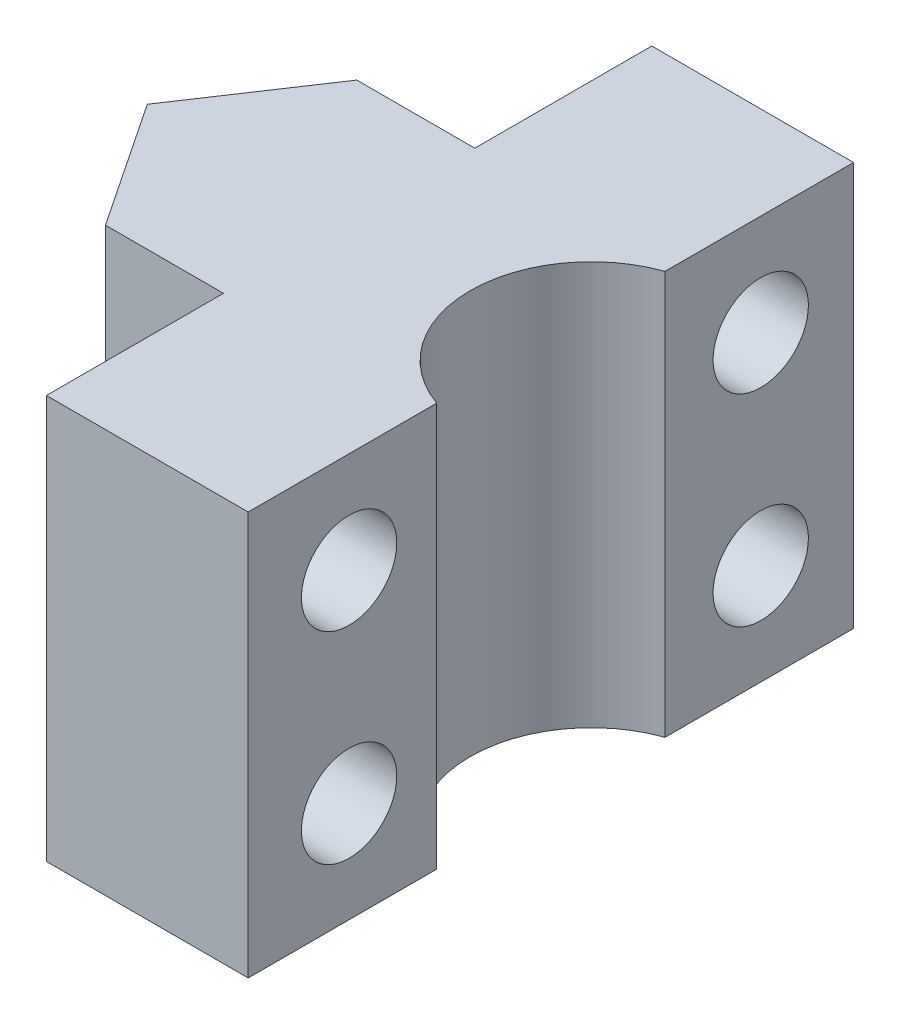
ISO-10303-21;
HEADER;
FILE_DESCRIPTION(('STEP AP214'),'2;1');
FILE_NAME('part.step','',(''),(''),'','','');
FILE_SCHEMA(('AUTOMOTIVE_DESIGN { 1 0 10303 214 1 1 1 1 }'));
ENDSEC;
DATA;
#1=APPLICATION_CONTEXT('core data for automotive mechanical design processes');
#2=APPLICATION_PROTOCOL_DEFINITION('international standard','automotive_design',2000,#1);
#3=PRODUCT_CONTEXT('',#1,'mechanical');
#4=PRODUCT('Part','Part','',(#3));
#5=PRODUCT_RELATED_PRODUCT_CATEGORY('part','',(#4));
#6=PRODUCT_DEFINITION_FORMATION('','',#4);
#7=PRODUCT_DEFINITION_CONTEXT('part definition',#1,'design');
#8=PRODUCT_DEFINITION('design','',#6,#7);
#9=PRODUCT_DEFINITION_SHAPE('','',#8);
#10=(LENGTH_UNIT() NAMED_UNIT(*) SI_UNIT(.MILLI.,.METRE.));
#11=(NAMED_UNIT(*) PLANE_ANGLE_UNIT() SI_UNIT($,.RADIAN.));
#12=(NAMED_UNIT(*) SI_UNIT($,.STERADIAN.) SOLID_ANGLE_UNIT());
#13=UNCERTAINTY_MEASURE_WITH_UNIT(LENGTH_MEASURE(1.E-05),#10,'distance_accuracy_value','');
#14=(GEOMETRIC_REPRESENTATION_CONTEXT(3) GLOBAL_UNCERTAINTY_ASSIGNED_CONTEXT((#13)) GLOBAL_UNIT_ASSIGNED_CONTEXT((#10,
#11,#12)) REPRESENTATION_CONTEXT('',''));
#15=CARTESIAN_POINT('',(0.,0.,0.));
#16=DIRECTION('',(0.,0.,1.));
#17=DIRECTION('',(1.,0.,0.));
#18=AXIS2_PLACEMENT_3D('',#15,#16,#17);
#19=CARTESIAN_POINT('',(0.,12.7,0.));
#20=DIRECTION('',(0.,-1.,0.));
#21=DIRECTION('',(0.,0.,-1.));
#22=AXIS2_PLACEMENT_3D('',#19,#20,#21);
#23=PLANE('',#22);
#24=DIRECTION('',(1.,0.,0.));
#25=VECTOR('',#24,1.);
#26=CARTESIAN_POINT('',(2.63646631403894,12.7,-13.4796994710584));
#27=LINE('',#26,#25);
#28=CARTESIAN_POINT('',(2.63646631403894,12.7,-13.4796994710584));
#29=VERTEX_POINT('',#28);
#30=CARTESIAN_POINT('',(6.35,12.7,-13.4796994710584));
#31=VERTEX_POINT('',#30);
#32=EDGE_CURVE('E121',#29,#31,#27,.T.);
#33=ORIENTED_EDGE('',*,*,#32,.F.);
#34=DIRECTION('',(0.554700196225229,0.,-0.832050294337844));
#35=VECTOR('',#34,1.);
#36=CARTESIAN_POINT('',(-4.39615384615385,12.7,-2.93076923076923));
#37=LINE('',#36,#35);
#38=CARTESIAN_POINT('',(0.,12.7,-9.52500000000001));
#39=VERTEX_POINT('',#38);
#40=EDGE_CURVE('E190',#39,#29,#37,.T.);
#41=ORIENTED_EDGE('',*,*,#40,.F.);
#42=DIRECTION('',(-0.554700196225229,0.,-0.832050294337844));
#43=VECTOR('',#42,1.);
#44=CARTESIAN_POINT('',(4.39615384615385,12.7,-2.93076923076923));
#45=LINE('',#44,#43);
#46=CARTESIAN_POINT('',(2.63646631403894,12.7,-5.5703005289416));
#47=VERTEX_POINT('',#46);
#48=EDGE_CURVE('E187',#47,#39,#45,.T.);
#49=ORIENTED_EDGE('',*,*,#48,.F.);
#50=DIRECTION('',(1.,0.,0.));
#51=VECTOR('',#50,1.);
#52=CARTESIAN_POINT('',(2.63646631403894,12.7,-5.5703005289416));
#53=LINE('',#52,#51);
#54=CARTESIAN_POINT('',(6.35,12.7,-5.5703005289416));
#55=VERTEX_POINT('',#54);
#56=EDGE_CURVE('E54',#47,#55,#53,.T.);
#57=ORIENTED_EDGE('',*,*,#56,.T.);
#58=DIRECTION('',(0.,0.,1.));
#59=VECTOR('',#58,1.);
#60=CARTESIAN_POINT('',(6.35,12.7,0.));
#61=LINE('',#60,#59);
#62=CARTESIAN_POINT('',(6.35,12.7,0.));
#63=VERTEX_POINT('',#62);
#64=EDGE_CURVE('E156',#55,#63,#61,.T.);
#65=ORIENTED_EDGE('',*,*,#64,.T.);
#66=DIRECTION('',(1.,0.,0.));
#67=VECTOR('',#66,1.);
#68=CARTESIAN_POINT('',(0.,12.7,0.));
#69=LINE('',#68,#67);
#70=CARTESIAN_POINT('',(12.7,12.7,0.));
#71=VERTEX_POINT('',#70);
#72=EDGE_CURVE('E207',#63,#71,#69,.T.);
#73=ORIENTED_EDGE('',*,*,#72,.T.);
#74=DIRECTION('',(0.,0.,-1.));
#75=VECTOR('',#74,1.);
#76=CARTESIAN_POINT('',(12.7,12.7,0.));
#77=LINE('',#76,#75);
#78=CARTESIAN_POINT('',(12.7,12.7,-5.93289755157234));
#79=VERTEX_POINT('',#78);
#80=EDGE_CURVE('E211',#71,#79,#77,.T.);
#81=ORIENTED_EDGE('',*,*,#80,.T.);
#82=CARTESIAN_POINT('',(13.97,12.7,-9.525));
#83=DIRECTION('',(0.,1.,0.));
#84=DIRECTION('',(0.,0.,1.));
#85=AXIS2_PLACEMENT_3D('',#82,#83,#84);
#86=CIRCLE('',#85,3.81);
#87=CARTESIAN_POINT('',(12.7,12.7,-13.1171024484277));
#88=VERTEX_POINT('',#87);
#89=EDGE_CURVE('E183',#88,#79,#86,.T.);
#90=ORIENTED_EDGE('',*,*,#89,.F.);
#91=CARTESIAN_POINT('',(12.7,12.7,-19.05));
#92=VERTEX_POINT('',#91);
#93=EDGE_CURVE('E209',#88,#92,#77,.T.);
#94=ORIENTED_EDGE('',*,*,#93,.T.);
#95=DIRECTION('',(-1.,0.,0.));
#96=VECTOR('',#95,1.);
#97=CARTESIAN_POINT('',(0.,12.7,-19.05));
#98=LINE('',#97,#96);
#99=CARTESIAN_POINT('',(6.35,12.7,-19.05));
#100=VERTEX_POINT('',#99);
#101=EDGE_CURVE('E144',#92,#100,#98,.T.);
#102=ORIENTED_EDGE('',*,*,#101,.T.);
#103=DIRECTION('',(0.,0.,-1.));
#104=VECTOR('',#103,1.);
#105=CARTESIAN_POINT('',(6.35,12.7,-19.05));
#106=LINE('',#105,#104);
#107=EDGE_CURVE('E132',#31,#100,#106,.T.);
#108=ORIENTED_EDGE('',*,*,#107,.F.);
#109=EDGE_LOOP('',(#33,#41,#49,#57,#65,#73,#81,#90,#94,#102,#108));
#110=FACE_BOUND('',#109,.T.);
#111=ADVANCED_FACE('F37',(#110),#23,.F.);
#112=CARTESIAN_POINT('',(0.,0.,0.));
#113=DIRECTION('',(0.,-1.,0.));
#114=DIRECTION('',(0.,0.,-1.));
#115=AXIS2_PLACEMENT_3D('',#112,#113,#114);
#116=PLANE('',#115);
#117=DIRECTION('',(0.554700196225229,0.,-0.832050294337844));
#118=VECTOR('',#117,1.);
#119=CARTESIAN_POINT('',(-4.39615384615385,0.,-2.93076923076923));
#120=LINE('',#119,#118);
#121=CARTESIAN_POINT('',(0.,0.,-9.52500000000001));
#122=VERTEX_POINT('',#121);
#123=CARTESIAN_POINT('',(2.63646631403894,0.,-13.4796994710584));
#124=VERTEX_POINT('',#123);
#125=EDGE_CURVE('E197',#122,#124,#120,.T.);
#126=ORIENTED_EDGE('',*,*,#125,.T.);
#127=DIRECTION('',(1.,0.,0.));
#128=VECTOR('',#127,1.);
#129=CARTESIAN_POINT('',(2.63646631403894,0.,-13.4796994710584));
#130=LINE('',#129,#128);
#131=CARTESIAN_POINT('',(6.35,0.,-13.4796994710584));
#132=VERTEX_POINT('',#131);
#133=EDGE_CURVE('E145',#124,#132,#130,.T.);
#134=ORIENTED_EDGE('',*,*,#133,.T.);
#135=DIRECTION('',(0.,0.,-1.));
#136=VECTOR('',#135,1.);
#137=CARTESIAN_POINT('',(6.35,0.,-19.05));
#138=LINE('',#137,#136);
#139=CARTESIAN_POINT('',(6.35,0.,-19.05));
#140=VERTEX_POINT('',#139);
#141=EDGE_CURVE('E139',#132,#140,#138,.T.);
#142=ORIENTED_EDGE('',*,*,#141,.T.);
#143=DIRECTION('',(-1.,0.,0.));
#144=VECTOR('',#143,1.);
#145=CARTESIAN_POINT('',(0.,0.,-19.05));
#146=LINE('',#145,#144);
#147=CARTESIAN_POINT('',(12.7,0.,-19.05));
#148=VERTEX_POINT('',#147);
#149=EDGE_CURVE('E210',#148,#140,#146,.T.);
#150=ORIENTED_EDGE('',*,*,#149,.F.);
#151=DIRECTION('',(0.,0.,-1.));
#152=VECTOR('',#151,1.);
#153=CARTESIAN_POINT('',(12.7,0.,0.));
#154=LINE('',#153,#152);
#155=CARTESIAN_POINT('',(12.7,0.,-13.1171024484277));
#156=VERTEX_POINT('',#155);
#157=EDGE_CURVE('E216',#156,#148,#154,.T.);
#158=ORIENTED_EDGE('',*,*,#157,.F.);
#159=CARTESIAN_POINT('',(13.97,0.,-9.525));
#160=DIRECTION('',(0.,1.,0.));
#161=DIRECTION('',(0.,0.,1.));
#162=AXIS2_PLACEMENT_3D('',#159,#160,#161);
#163=CIRCLE('',#162,3.81);
#164=CARTESIAN_POINT('',(12.7,0.,-5.93289755157234));
#165=VERTEX_POINT('',#164);
#166=EDGE_CURVE('E191',#156,#165,#163,.T.);
#167=ORIENTED_EDGE('',*,*,#166,.T.);
#168=CARTESIAN_POINT('',(12.7,0.,0.));
#169=VERTEX_POINT('',#168);
#170=EDGE_CURVE('E217',#169,#165,#154,.T.);
#171=ORIENTED_EDGE('',*,*,#170,.F.);
#172=DIRECTION('',(1.,0.,0.));
#173=VECTOR('',#172,1.);
#174=CARTESIAN_POINT('',(0.,0.,0.));
#175=LINE('',#174,#173);
#176=CARTESIAN_POINT('',(6.35,0.,0.));
#177=VERTEX_POINT('',#176);
#178=EDGE_CURVE('E204',#177,#169,#175,.T.);
#179=ORIENTED_EDGE('',*,*,#178,.F.);
#180=DIRECTION('',(0.,0.,1.));
#181=VECTOR('',#180,1.);
#182=CARTESIAN_POINT('',(6.35,0.,0.));
#183=LINE('',#182,#181);
#184=CARTESIAN_POINT('',(6.35,0.,-5.5703005289416));
#185=VERTEX_POINT('',#184);
#186=EDGE_CURVE('E157',#185,#177,#183,.T.);
#187=ORIENTED_EDGE('',*,*,#186,.F.);
#188=DIRECTION('',(1.,0.,0.));
#189=VECTOR('',#188,1.);
#190=CARTESIAN_POINT('',(2.63646631403894,0.,-5.5703005289416));
#191=LINE('',#190,#189);
#192=CARTESIAN_POINT('',(2.63646631403894,0.,-5.5703005289416));
#193=VERTEX_POINT('',#192);
#194=EDGE_CURVE('E154',#193,#185,#191,.T.);
#195=ORIENTED_EDGE('',*,*,#194,.F.);
#196=DIRECTION('',(-0.554700196225229,0.,-0.832050294337844));
#197=VECTOR('',#196,1.);
#198=CARTESIAN_POINT('',(4.39615384615385,0.,-2.93076923076923));
#199=LINE('',#198,#197);
#200=EDGE_CURVE('E184',#193,#122,#199,.T.);
#201=ORIENTED_EDGE('',*,*,#200,.T.);
#202=EDGE_LOOP('',(#126,#134,#142,#150,#158,#167,#171,#179,#187,#195,#201));
#203=FACE_BOUND('',#202,.T.);
#204=ADVANCED_FACE('F257',(#203),#116,.T.);
#205=CARTESIAN_POINT('',(-4.39615384615385,0.,-2.93076923076923));
#206=DIRECTION('',(0.832050294337844,0.,0.554700196225229));
#207=DIRECTION('',(0.554700196225229,0.,-0.832050294337844));
#208=AXIS2_PLACEMENT_3D('',#205,#206,#207);
#209=PLANE('',#208);
#210=DIRECTION('',(0.,-1.,0.));
#211=VECTOR('',#210,1.);
#212=CARTESIAN_POINT('',(2.63646631403894,12.7,-13.4796994710584));
#213=LINE('',#212,#211);
#214=EDGE_CURVE('E127',#29,#124,#213,.T.);
#215=ORIENTED_EDGE('',*,*,#214,.T.);
#216=ORIENTED_EDGE('',*,*,#125,.F.);
#217=DIRECTION('',(0.,1.,0.));
#218=VECTOR('',#217,1.);
#219=CARTESIAN_POINT('',(0.,0.,-9.52500000000001));
#220=LINE('',#219,#218);
#221=EDGE_CURVE('E200',#122,#39,#220,.T.);
#222=ORIENTED_EDGE('',*,*,#221,.T.);
#223=ORIENTED_EDGE('',*,*,#40,.T.);
#224=EDGE_LOOP('',(#215,#216,#222,#223));
#225=FACE_BOUND('',#224,.T.);
#226=ADVANCED_FACE('F275',(#225),#209,.F.);
#227=CARTESIAN_POINT('',(0.,9.525,-16.129));
#228=DIRECTION('',(1.,0.,0.));
#229=DIRECTION('',(0.,0.,-1.));
#230=AXIS2_PLACEMENT_3D('',#227,#228,#229);
#231=CYLINDRICAL_SURFACE('',#230,1.5);
#232=CARTESIAN_POINT('',(12.7,9.525,-16.129));
#233=DIRECTION('',(1.,0.,0.));
#234=DIRECTION('',(0.,0.,-1.));
#235=AXIS2_PLACEMENT_3D('',#232,#233,#234);
#236=CIRCLE('',#235,1.5);
#237=CARTESIAN_POINT('',(12.7,9.525,-17.629));
#238=VERTEX_POINT('',#237);
#239=EDGE_CURVE('E172',#238,#238,#236,.T.);
#240=ORIENTED_EDGE('',*,*,#239,.T.);
#241=EDGE_LOOP('',(#240));
#242=FACE_BOUND('',#241,.T.);
#243=CARTESIAN_POINT('',(6.35,9.525,-16.129));
#244=DIRECTION('',(-1.,0.,0.));
#245=DIRECTION('',(0.,0.,1.));
#246=AXIS2_PLACEMENT_3D('',#243,#244,#245);
#247=CIRCLE('',#246,1.5);
#248=CARTESIAN_POINT('',(6.35,9.525,-14.629));
#249=VERTEX_POINT('',#248);
#250=EDGE_CURVE('E151',#249,#249,#247,.F.);
#251=ORIENTED_EDGE('',*,*,#250,.F.);
#252=EDGE_LOOP('',(#251));
#253=FACE_BOUND('',#252,.T.);
#254=ADVANCED_FACE('F305',(#242,#253),#231,.F.);
#255=CARTESIAN_POINT('',(0.,3.175,-16.1290000000001));
#256=DIRECTION('',(1.,0.,0.));
#257=DIRECTION('',(0.,0.,-1.));
#258=AXIS2_PLACEMENT_3D('',#255,#256,#257);
#259=CYLINDRICAL_SURFACE('',#258,1.5);
#260=CARTESIAN_POINT('',(12.7,3.175,-16.1290000000001));
#261=DIRECTION('',(1.,0.,0.));
#262=DIRECTION('',(0.,0.,-1.));
#263=AXIS2_PLACEMENT_3D('',#260,#261,#262);
#264=CIRCLE('',#263,1.5);
#265=CARTESIAN_POINT('',(12.7,3.175,-17.6290000000001));
#266=VERTEX_POINT('',#265);
#267=EDGE_CURVE('E176',#266,#266,#264,.T.);
#268=ORIENTED_EDGE('',*,*,#267,.T.);
#269=EDGE_LOOP('',(#268));
#270=FACE_BOUND('',#269,.T.);
#271=CARTESIAN_POINT('',(6.35,3.175,-16.1290000000001));
#272=DIRECTION('',(-1.,0.,0.));
#273=DIRECTION('',(0.,0.,1.));
#274=AXIS2_PLACEMENT_3D('',#271,#272,#273);
#275=CIRCLE('',#274,1.5);
#276=CARTESIAN_POINT('',(6.35,3.175,-14.6290000000001));
#277=VERTEX_POINT('',#276);
#278=EDGE_CURVE('E41',#277,#277,#275,.F.);
#279=ORIENTED_EDGE('',*,*,#278,.F.);
#280=EDGE_LOOP('',(#279));
#281=FACE_BOUND('',#280,.T.);
#282=ADVANCED_FACE('F249',(#270,#281),#259,.F.);
#283=CARTESIAN_POINT('',(12.7,12.7,0.));
#284=DIRECTION('',(-1.,0.,0.));
#285=DIRECTION('',(0.,0.,1.));
#286=AXIS2_PLACEMENT_3D('',#283,#284,#285);
#287=PLANE('',#286);
#288=CARTESIAN_POINT('',(12.7,3.175,-3.17500000000007));
#289=DIRECTION('',(1.,0.,0.));
#290=DIRECTION('',(0.,0.,-1.));
#291=AXIS2_PLACEMENT_3D('',#288,#289,#290);
#292=CIRCLE('',#291,1.5);
#293=CARTESIAN_POINT('',(12.7,3.175,-4.67500000000007));
#294=VERTEX_POINT('',#293);
#295=EDGE_CURVE('E171',#294,#294,#292,.T.);
#296=ORIENTED_EDGE('',*,*,#295,.F.);
#297=EDGE_LOOP('',(#296));
#298=FACE_BOUND('',#297,.T.);
#299=CARTESIAN_POINT('',(12.7,9.525,-3.175));
#300=DIRECTION('',(1.,0.,0.));
#301=DIRECTION('',(0.,0.,-1.));
#302=AXIS2_PLACEMENT_3D('',#299,#300,#301);
#303=CIRCLE('',#302,1.5);
#304=CARTESIAN_POINT('',(12.7,9.525,-4.675));
#305=VERTEX_POINT('',#304);
#306=EDGE_CURVE('E175',#305,#305,#303,.T.);
#307=ORIENTED_EDGE('',*,*,#306,.F.);
#308=EDGE_LOOP('',(#307));
#309=FACE_BOUND('',#308,.T.);
#310=ORIENTED_EDGE('',*,*,#170,.T.);
#311=DIRECTION('',(0.,1.,0.));
#312=VECTOR('',#311,1.);
#313=CARTESIAN_POINT('',(12.7,0.,-5.93289755157234));
#314=LINE('',#313,#312);
#315=EDGE_CURVE('E62',#165,#79,#314,.T.);
#316=ORIENTED_EDGE('',*,*,#315,.T.);
#317=ORIENTED_EDGE('',*,*,#80,.F.);
#318=DIRECTION('',(0.,-1.,0.));
#319=VECTOR('',#318,1.);
#320=CARTESIAN_POINT('',(12.7,12.7,0.));
#321=LINE('',#320,#319);
#322=EDGE_CURVE('E12',#71,#169,#321,.T.);
#323=ORIENTED_EDGE('',*,*,#322,.T.);
#324=EDGE_LOOP('',(#310,#316,#317,#323));
#325=FACE_BOUND('',#324,.T.);
#326=ADVANCED_FACE('F246',(#298,#309,#325),#287,.F.);
#327=CARTESIAN_POINT('',(0.,12.7,0.));
#328=DIRECTION('',(0.,0.,-1.));
#329=DIRECTION('',(-1.,0.,0.));
#330=AXIS2_PLACEMENT_3D('',#327,#328,#329);
#331=PLANE('',#330);
#332=ORIENTED_EDGE('',*,*,#72,.F.);
#333=DIRECTION('',(0.,1.,0.));
#334=VECTOR('',#333,1.);
#335=CARTESIAN_POINT('',(6.35,0.,0.));
#336=LINE('',#335,#334);
#337=EDGE_CURVE('E186',#177,#63,#336,.T.);
#338=ORIENTED_EDGE('',*,*,#337,.F.);
#339=ORIENTED_EDGE('',*,*,#178,.T.);
#340=ORIENTED_EDGE('',*,*,#322,.F.);
#341=EDGE_LOOP('',(#332,#338,#339,#340));
#342=FACE_BOUND('',#341,.T.);
#343=ADVANCED_FACE('F39',(#342),#331,.F.);
#344=ORIENTED_EDGE('',*,*,#267,.F.);
#345=EDGE_LOOP('',(#344));
#346=FACE_BOUND('',#345,.T.);
#347=ORIENTED_EDGE('',*,*,#239,.F.);
#348=EDGE_LOOP('',(#347));
#349=FACE_BOUND('',#348,.T.);
#350=ORIENTED_EDGE('',*,*,#93,.F.);
#351=DIRECTION('',(0.,1.,0.));
#352=VECTOR('',#351,1.);
#353=CARTESIAN_POINT('',(12.7,0.,-13.1171024484277));
#354=LINE('',#353,#352);
#355=EDGE_CURVE('E193',#156,#88,#354,.T.);
#356=ORIENTED_EDGE('',*,*,#355,.F.);
#357=ORIENTED_EDGE('',*,*,#157,.T.);
#358=DIRECTION('',(0.,-1.,0.));
#359=VECTOR('',#358,1.);
#360=CARTESIAN_POINT('',(12.7,12.7,-19.05));
#361=LINE('',#360,#359);
#362=EDGE_CURVE('E46',#92,#148,#361,.T.);
#363=ORIENTED_EDGE('',*,*,#362,.F.);
#364=EDGE_LOOP('',(#350,#356,#357,#363));
#365=FACE_BOUND('',#364,.T.);
#366=ADVANCED_FACE('F251',(#346,#349,#365),#287,.F.);
#367=CARTESIAN_POINT('',(0.,12.7,-19.05));
#368=DIRECTION('',(0.,0.,1.));
#369=DIRECTION('',(1.,0.,0.));
#370=AXIS2_PLACEMENT_3D('',#367,#368,#369);
#371=PLANE('',#370);
#372=ORIENTED_EDGE('',*,*,#149,.T.);
#373=DIRECTION('',(0.,1.,0.));
#374=VECTOR('',#373,1.);
#375=CARTESIAN_POINT('',(6.35,0.,-19.05));
#376=LINE('',#375,#374);
#377=EDGE_CURVE('E202',#140,#100,#376,.T.);
#378=ORIENTED_EDGE('',*,*,#377,.T.);
#379=ORIENTED_EDGE('',*,*,#101,.F.);
#380=ORIENTED_EDGE('',*,*,#362,.T.);
#381=EDGE_LOOP('',(#372,#378,#379,#380));
#382=FACE_BOUND('',#381,.T.);
#383=ADVANCED_FACE('F293',(#382),#371,.F.);
#384=CARTESIAN_POINT('',(4.39615384615385,0.,-2.93076923076923));
#385=DIRECTION('',(0.832050294337844,0.,-0.554700196225229));
#386=DIRECTION('',(-0.554700196225229,0.,-0.832050294337844));
#387=AXIS2_PLACEMENT_3D('',#384,#385,#386);
#388=PLANE('',#387);
#389=ORIENTED_EDGE('',*,*,#200,.F.);
#390=DIRECTION('',(0.,-1.,0.));
#391=VECTOR('',#390,1.);
#392=CARTESIAN_POINT('',(2.63646631403894,12.7,-5.5703005289416));
#393=LINE('',#392,#391);
#394=EDGE_CURVE('E160',#47,#193,#393,.T.);
#395=ORIENTED_EDGE('',*,*,#394,.F.);
#396=ORIENTED_EDGE('',*,*,#48,.T.);
#397=ORIENTED_EDGE('',*,*,#221,.F.);
#398=EDGE_LOOP('',(#389,#395,#396,#397));
#399=FACE_BOUND('',#398,.T.);
#400=ADVANCED_FACE('F272',(#399),#388,.F.);
#401=CARTESIAN_POINT('',(13.97,0.,-9.525));
#402=DIRECTION('',(0.,1.,0.));
#403=DIRECTION('',(0.,0.,1.));
#404=AXIS2_PLACEMENT_3D('',#401,#402,#403);
#405=CYLINDRICAL_SURFACE('',#404,3.81);
#406=ORIENTED_EDGE('',*,*,#89,.T.);
#407=ORIENTED_EDGE('',*,*,#315,.F.);
#408=ORIENTED_EDGE('',*,*,#166,.F.);
#409=ORIENTED_EDGE('',*,*,#355,.T.);
#410=EDGE_LOOP('',(#406,#407,#408,#409));
#411=FACE_BOUND('',#410,.T.);
#412=ADVANCED_FACE('F242',(#411),#405,.F.);
#413=CARTESIAN_POINT('',(0.,9.525,-3.175));
#414=DIRECTION('',(1.,0.,0.));
#415=DIRECTION('',(0.,0.,-1.));
#416=AXIS2_PLACEMENT_3D('',#413,#414,#415);
#417=CYLINDRICAL_SURFACE('',#416,1.5);
#418=CARTESIAN_POINT('',(6.35,9.525,-3.175));
#419=DIRECTION('',(1.,0.,0.));
#420=DIRECTION('',(0.,0.,-1.));
#421=AXIS2_PLACEMENT_3D('',#418,#419,#420);
#422=CIRCLE('',#421,1.5);
#423=CARTESIAN_POINT('',(6.35,9.525,-4.675));
#424=VERTEX_POINT('',#423);
#425=EDGE_CURVE('E168',#424,#424,#422,.F.);
#426=ORIENTED_EDGE('',*,*,#425,.T.);
#427=EDGE_LOOP('',(#426));
#428=FACE_BOUND('',#427,.T.);
#429=ORIENTED_EDGE('',*,*,#306,.T.);
#430=EDGE_LOOP('',(#429));
#431=FACE_BOUND('',#430,.T.);
#432=ADVANCED_FACE('F239',(#428,#431),#417,.F.);
#433=CARTESIAN_POINT('',(0.,3.175,-3.17500000000007));
#434=DIRECTION('',(1.,0.,0.));
#435=DIRECTION('',(0.,0.,-1.));
#436=AXIS2_PLACEMENT_3D('',#433,#434,#435);
#437=CYLINDRICAL_SURFACE('',#436,1.5);
#438=CARTESIAN_POINT('',(6.35,3.175,-3.17500000000007));
#439=DIRECTION('',(1.,0.,0.));
#440=DIRECTION('',(0.,0.,-1.));
#441=AXIS2_PLACEMENT_3D('',#438,#439,#440);
#442=CIRCLE('',#441,1.5);
#443=CARTESIAN_POINT('',(6.35,3.175,-4.67500000000007));
#444=VERTEX_POINT('',#443);
#445=EDGE_CURVE('E166',#444,#444,#442,.F.);
#446=ORIENTED_EDGE('',*,*,#445,.T.);
#447=EDGE_LOOP('',(#446));
#448=FACE_BOUND('',#447,.T.);
#449=ORIENTED_EDGE('',*,*,#295,.T.);
#450=EDGE_LOOP('',(#449));
#451=FACE_BOUND('',#450,.T.);
#452=ADVANCED_FACE('F226',(#448,#451),#437,.F.);
#453=CARTESIAN_POINT('',(6.35,12.7,0.));
#454=DIRECTION('',(1.,0.,0.));
#455=DIRECTION('',(0.,0.,-1.));
#456=AXIS2_PLACEMENT_3D('',#453,#454,#455);
#457=PLANE('',#456);
#458=ORIENTED_EDGE('',*,*,#445,.F.);
#459=EDGE_LOOP('',(#458));
#460=FACE_BOUND('',#459,.T.);
#461=ORIENTED_EDGE('',*,*,#186,.T.);
#462=ORIENTED_EDGE('',*,*,#337,.T.);
#463=ORIENTED_EDGE('',*,*,#64,.F.);
#464=DIRECTION('',(0.,-1.,0.));
#465=VECTOR('',#464,1.);
#466=CARTESIAN_POINT('',(6.35,12.7,-5.5703005289416));
#467=LINE('',#466,#465);
#468=EDGE_CURVE('E164',#55,#185,#467,.T.);
#469=ORIENTED_EDGE('',*,*,#468,.T.);
#470=EDGE_LOOP('',(#461,#462,#463,#469));
#471=FACE_BOUND('',#470,.T.);
#472=ORIENTED_EDGE('',*,*,#425,.F.);
#473=EDGE_LOOP('',(#472));
#474=FACE_BOUND('',#473,.T.);
#475=ADVANCED_FACE('F229',(#460,#471,#474),#457,.F.);
#476=CARTESIAN_POINT('',(2.63646631403894,12.7,-5.5703005289416));
#477=DIRECTION('',(0.,0.,-1.));
#478=DIRECTION('',(-1.,0.,0.));
#479=AXIS2_PLACEMENT_3D('',#476,#477,#478);
#480=PLANE('',#479);
#481=ORIENTED_EDGE('',*,*,#194,.T.);
#482=ORIENTED_EDGE('',*,*,#468,.F.);
#483=ORIENTED_EDGE('',*,*,#56,.F.);
#484=ORIENTED_EDGE('',*,*,#394,.T.);
#485=EDGE_LOOP('',(#481,#482,#483,#484));
#486=FACE_BOUND('',#485,.T.);
#487=ADVANCED_FACE('F232',(#486),#480,.F.);
#488=CARTESIAN_POINT('',(6.35,12.7,-19.05));
#489=DIRECTION('',(-1.,0.,0.));
#490=DIRECTION('',(0.,0.,1.));
#491=AXIS2_PLACEMENT_3D('',#488,#489,#490);
#492=PLANE('',#491);
#493=ORIENTED_EDGE('',*,*,#141,.F.);
#494=DIRECTION('',(0.,-1.,0.));
#495=VECTOR('',#494,1.);
#496=CARTESIAN_POINT('',(6.35,12.7,-13.4796994710584));
#497=LINE('',#496,#495);
#498=EDGE_CURVE('E124',#31,#132,#497,.T.);
#499=ORIENTED_EDGE('',*,*,#498,.F.);
#500=ORIENTED_EDGE('',*,*,#107,.T.);
#501=ORIENTED_EDGE('',*,*,#377,.F.);
#502=EDGE_LOOP('',(#493,#499,#500,#501));
#503=FACE_BOUND('',#502,.T.);
#504=ORIENTED_EDGE('',*,*,#278,.T.);
#505=EDGE_LOOP('',(#504));
#506=FACE_BOUND('',#505,.T.);
#507=ORIENTED_EDGE('',*,*,#250,.T.);
#508=EDGE_LOOP('',(#507));
#509=FACE_BOUND('',#508,.T.);
#510=ADVANCED_FACE('F135',(#503,#506,#509),#492,.T.);
#511=CARTESIAN_POINT('',(2.63646631403894,12.7,-13.4796994710584));
#512=DIRECTION('',(0.,0.,-1.));
#513=DIRECTION('',(-1.,0.,0.));
#514=AXIS2_PLACEMENT_3D('',#511,#512,#513);
#515=PLANE('',#514);
#516=ORIENTED_EDGE('',*,*,#133,.F.);
#517=ORIENTED_EDGE('',*,*,#214,.F.);
#518=ORIENTED_EDGE('',*,*,#32,.T.);
#519=ORIENTED_EDGE('',*,*,#498,.T.);
#520=EDGE_LOOP('',(#516,#517,#518,#519));
#521=FACE_BOUND('',#520,.T.);
#522=ADVANCED_FACE('F123',(#521),#515,.T.);
#523=CLOSED_SHELL('',(#111,#204,#226,#254,#282,#326,#343,#366,#383,#400,#412,#432,#452,#475,
#487,#510,#522));
#524=MANIFOLD_SOLID_BREP('B2',#523);
#525=ADVANCED_BREP_SHAPE_REPRESENTATION('',(#18,#524),#14);
#526=SHAPE_DEFINITION_REPRESENTATION(#9,#525);
ENDSEC;
END-ISO-10303-21;
